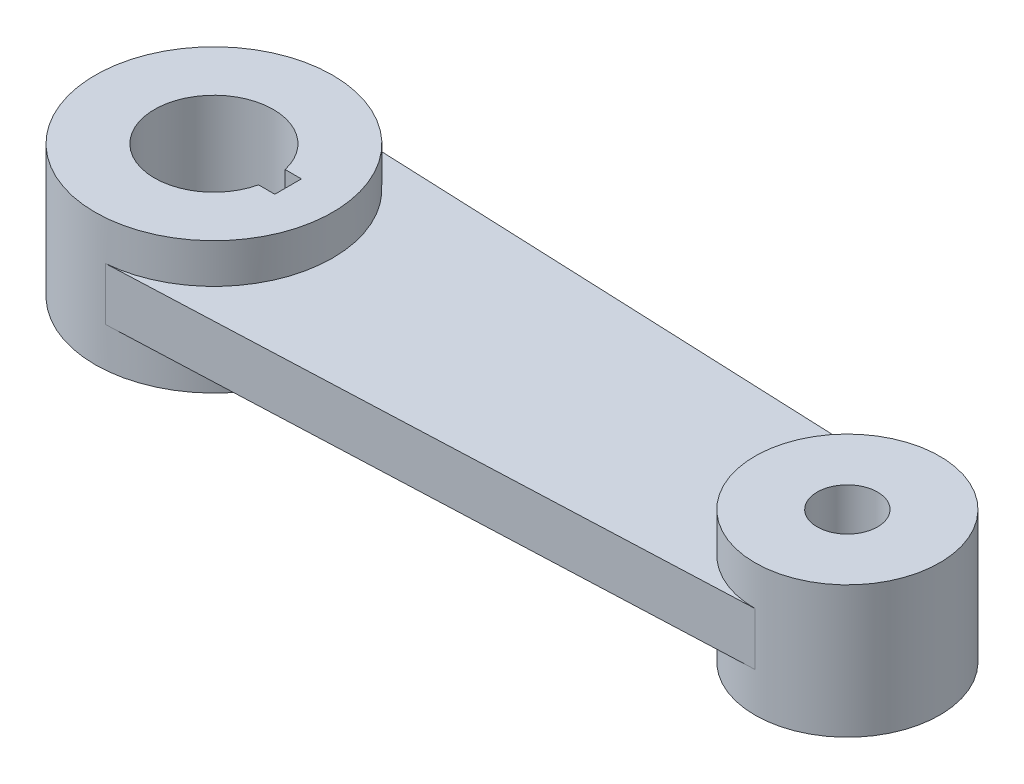
ISO-10303-21;
HEADER;
FILE_DESCRIPTION(('STEP AP214'),'2;1');
FILE_NAME('part.step','',(''),(''),'','','');
FILE_SCHEMA(('AUTOMOTIVE_DESIGN { 1 0 10303 214 1 1 1 1 }'));
ENDSEC;
DATA;
#1=APPLICATION_CONTEXT('core data for automotive mechanical design processes');
#2=APPLICATION_PROTOCOL_DEFINITION('international standard','automotive_design',2000,#1);
#3=PRODUCT_CONTEXT('',#1,'mechanical');
#4=PRODUCT('Part','Part','',(#3));
#5=PRODUCT_RELATED_PRODUCT_CATEGORY('part','',(#4));
#6=PRODUCT_DEFINITION_FORMATION('','',#4);
#7=PRODUCT_DEFINITION_CONTEXT('part definition',#1,'design');
#8=PRODUCT_DEFINITION('design','',#6,#7);
#9=PRODUCT_DEFINITION_SHAPE('','',#8);
#10=(LENGTH_UNIT() NAMED_UNIT(*) SI_UNIT(.MILLI.,.METRE.));
#11=(NAMED_UNIT(*) PLANE_ANGLE_UNIT() SI_UNIT($,.RADIAN.));
#12=(NAMED_UNIT(*) SI_UNIT($,.STERADIAN.) SOLID_ANGLE_UNIT());
#13=UNCERTAINTY_MEASURE_WITH_UNIT(LENGTH_MEASURE(1.E-05),#10,'distance_accuracy_value','');
#14=(GEOMETRIC_REPRESENTATION_CONTEXT(3) GLOBAL_UNCERTAINTY_ASSIGNED_CONTEXT((#13)) GLOBAL_UNIT_ASSIGNED_CONTEXT((#10,
#11,#12)) REPRESENTATION_CONTEXT('',''));
#15=CARTESIAN_POINT('',(0.,0.,0.));
#16=DIRECTION('',(0.,0.,1.));
#17=DIRECTION('',(1.,0.,0.));
#18=AXIS2_PLACEMENT_3D('',#15,#16,#17);
#19=CARTESIAN_POINT('',(150.,31.25,0.));
#20=DIRECTION('',(0.,1.,0.));
#21=DIRECTION('',(0.,0.,1.));
#22=AXIS2_PLACEMENT_3D('',#19,#20,#21);
#23=PLANE('',#22);
#24=CARTESIAN_POINT('',(150.,31.25,0.));
#25=DIRECTION('',(0.,1.,0.));
#26=DIRECTION('',(0.,0.,1.));
#27=AXIS2_PLACEMENT_3D('',#24,#25,#26);
#28=CIRCLE('',#27,14.3009812980512);
#29=CARTESIAN_POINT('',(150.,31.25,14.3009812980511));
#30=VERTEX_POINT('',#29);
#31=EDGE_CURVE('E131',#30,#30,#28,.T.);
#32=ORIENTED_EDGE('',*,*,#31,.F.);
#33=EDGE_LOOP('',(#32));
#34=FACE_BOUND('',#33,.T.);
#35=CARTESIAN_POINT('',(150.,31.25,0.));
#36=DIRECTION('',(0.,1.,0.));
#37=DIRECTION('',(0.,0.,1.));
#38=AXIS2_PLACEMENT_3D('',#35,#36,#37);
#39=CIRCLE('',#38,43.75);
#40=CARTESIAN_POINT('',(150.,31.25,43.75));
#41=VERTEX_POINT('',#40);
#42=EDGE_CURVE('E149',#41,#41,#39,.T.);
#43=ORIENTED_EDGE('',*,*,#42,.T.);
#44=EDGE_LOOP('',(#43));
#45=FACE_BOUND('',#44,.T.);
#46=ADVANCED_FACE('F33',(#34,#45),#23,.T.);
#47=CARTESIAN_POINT('',(2.07972270363952,12.5,49.9133448873483));
#48=DIRECTION('',(0.0416305447121814,0.,0.999133073092352));
#49=DIRECTION('',(0.999133073092352,0.,-0.0416305447121814));
#50=AXIS2_PLACEMENT_3D('',#47,#48,#49);
#51=PLANE('',#50);
#52=DIRECTION('',(0.,1.,0.));
#53=VECTOR('',#52,1.);
#54=CARTESIAN_POINT('',(-145.320623916811,-31.25,56.0550259965338));
#55=LINE('',#54,#53);
#56=CARTESIAN_POINT('',(-145.320623916811,-12.5,56.0550259965338));
#57=VERTEX_POINT('',#56);
#58=CARTESIAN_POINT('',(-145.320623916811,12.5,56.0550259965338));
#59=VERTEX_POINT('',#58);
#60=EDGE_CURVE('E150',#57,#59,#55,.T.);
#61=ORIENTED_EDGE('',*,*,#60,.F.);
#62=DIRECTION('',(-0.999133073092352,0.,0.0416305447121814));
#63=VECTOR('',#62,1.);
#64=CARTESIAN_POINT('',(2.07972270363952,-12.5,49.9133448873483));
#65=LINE('',#64,#63);
#66=CARTESIAN_POINT('',(150.,-12.5,43.75));
#67=VERTEX_POINT('',#66);
#68=EDGE_CURVE('E161',#67,#57,#65,.T.);
#69=ORIENTED_EDGE('',*,*,#68,.F.);
#70=DIRECTION('',(0.,-1.,0.));
#71=VECTOR('',#70,1.);
#72=CARTESIAN_POINT('',(150.,12.5,43.75));
#73=LINE('',#72,#71);
#74=CARTESIAN_POINT('',(150.,12.5,43.75));
#75=VERTEX_POINT('',#74);
#76=EDGE_CURVE('E174',#75,#67,#73,.T.);
#77=ORIENTED_EDGE('',*,*,#76,.F.);
#78=DIRECTION('',(-0.999133073092352,0.,0.0416305447121814));
#79=VECTOR('',#78,1.);
#80=CARTESIAN_POINT('',(2.07972270363952,12.5,49.9133448873483));
#81=LINE('',#80,#79);
#82=EDGE_CURVE('E162',#75,#59,#81,.T.);
#83=ORIENTED_EDGE('',*,*,#82,.T.);
#84=EDGE_LOOP('',(#61,#69,#77,#83));
#85=FACE_BOUND('',#84,.T.);
#86=ADVANCED_FACE('F35',(#85),#51,.T.);
#87=CARTESIAN_POINT('',(150.,12.5,0.));
#88=DIRECTION('',(0.,-1.,0.));
#89=DIRECTION('',(0.,0.,-1.));
#90=AXIS2_PLACEMENT_3D('',#87,#88,#89);
#91=CYLINDRICAL_SURFACE('',#90,43.75);
#92=ORIENTED_EDGE('',*,*,#76,.T.);
#93=CARTESIAN_POINT('',(150.,-12.5,0.));
#94=DIRECTION('',(0.,1.,0.));
#95=DIRECTION('',(0.,0.,1.));
#96=AXIS2_PLACEMENT_3D('',#93,#94,#95);
#97=CIRCLE('',#96,43.75);
#98=CARTESIAN_POINT('',(150.,-12.5,-43.7500000000001));
#99=VERTEX_POINT('',#98);
#100=EDGE_CURVE('E41',#99,#67,#97,.T.);
#101=ORIENTED_EDGE('',*,*,#100,.F.);
#102=DIRECTION('',(0.,-1.,0.));
#103=VECTOR('',#102,1.);
#104=CARTESIAN_POINT('',(150.,12.5,-43.7500000000001));
#105=LINE('',#104,#103);
#106=CARTESIAN_POINT('',(150.,12.5,-43.7500000000001));
#107=VERTEX_POINT('',#106);
#108=EDGE_CURVE('E168',#107,#99,#105,.T.);
#109=ORIENTED_EDGE('',*,*,#108,.F.);
#110=CARTESIAN_POINT('',(150.,12.5,0.));
#111=DIRECTION('',(0.,1.,0.));
#112=DIRECTION('',(0.,0.,1.));
#113=AXIS2_PLACEMENT_3D('',#110,#111,#112);
#114=CIRCLE('',#113,43.75);
#115=EDGE_CURVE('E158',#107,#75,#114,.T.);
#116=ORIENTED_EDGE('',*,*,#115,.T.);
#117=EDGE_LOOP('',(#92,#101,#109,#116));
#118=FACE_BOUND('',#117,.T.);
#119=CARTESIAN_POINT('',(150.,-31.25,0.));
#120=DIRECTION('',(0.,1.,0.));
#121=DIRECTION('',(0.,0.,1.));
#122=AXIS2_PLACEMENT_3D('',#119,#120,#121);
#123=CIRCLE('',#122,43.75);
#124=CARTESIAN_POINT('',(150.,-31.25,43.75));
#125=VERTEX_POINT('',#124);
#126=EDGE_CURVE('E155',#125,#125,#123,.T.);
#127=ORIENTED_EDGE('',*,*,#126,.T.);
#128=EDGE_LOOP('',(#127));
#129=FACE_BOUND('',#128,.T.);
#130=ORIENTED_EDGE('',*,*,#42,.F.);
#131=EDGE_LOOP('',(#130));
#132=FACE_BOUND('',#131,.T.);
#133=ADVANCED_FACE('F184',(#118,#129,#132),#91,.T.);
#134=CARTESIAN_POINT('',(2.0797227036395,12.5,-49.9133448873484));
#135=DIRECTION('',(0.0416305447121811,0.,-0.999133073092352));
#136=DIRECTION('',(-0.999133073092352,0.,-0.0416305447121811));
#137=AXIS2_PLACEMENT_3D('',#134,#135,#136);
#138=PLANE('',#137);
#139=DIRECTION('',(0.,1.,0.));
#140=VECTOR('',#139,1.);
#141=CARTESIAN_POINT('',(-145.320623916812,-31.25,-56.0550259965338));
#142=LINE('',#141,#140);
#143=CARTESIAN_POINT('',(-145.320623916812,12.5,-56.0550259965338));
#144=VERTEX_POINT('',#143);
#145=CARTESIAN_POINT('',(-145.320623916811,-12.5,-56.0550259965338));
#146=VERTEX_POINT('',#145);
#147=EDGE_CURVE('E146',#144,#146,#142,.F.);
#148=ORIENTED_EDGE('',*,*,#147,.F.);
#149=DIRECTION('',(0.999133073092352,0.,0.0416305447121811));
#150=VECTOR('',#149,1.);
#151=CARTESIAN_POINT('',(2.0797227036395,12.5,-49.9133448873484));
#152=LINE('',#151,#150);
#153=EDGE_CURVE('E165',#144,#107,#152,.T.);
#154=ORIENTED_EDGE('',*,*,#153,.T.);
#155=ORIENTED_EDGE('',*,*,#108,.T.);
#156=DIRECTION('',(0.999133073092352,0.,0.0416305447121811));
#157=VECTOR('',#156,1.);
#158=CARTESIAN_POINT('',(2.0797227036395,-12.5,-49.9133448873484));
#159=LINE('',#158,#157);
#160=EDGE_CURVE('E166',#146,#99,#159,.T.);
#161=ORIENTED_EDGE('',*,*,#160,.F.);
#162=EDGE_LOOP('',(#148,#154,#155,#161));
#163=FACE_BOUND('',#162,.T.);
#164=ADVANCED_FACE('F198',(#163),#138,.T.);
#165=CARTESIAN_POINT('',(0.,12.5,0.));
#166=DIRECTION('',(0.,1.,0.));
#167=DIRECTION('',(0.,0.,1.));
#168=AXIS2_PLACEMENT_3D('',#165,#166,#167);
#169=PLANE('',#168);
#170=CARTESIAN_POINT('',(-150.,12.5,0.));
#171=DIRECTION('',(0.,1.,0.));
#172=DIRECTION('',(0.,0.,1.));
#173=AXIS2_PLACEMENT_3D('',#170,#171,#172);
#174=CIRCLE('',#173,56.25);
#175=EDGE_CURVE('E147',#59,#144,#174,.T.);
#176=ORIENTED_EDGE('',*,*,#175,.F.);
#177=ORIENTED_EDGE('',*,*,#82,.F.);
#178=ORIENTED_EDGE('',*,*,#115,.F.);
#179=ORIENTED_EDGE('',*,*,#153,.F.);
#180=EDGE_LOOP('',(#176,#177,#178,#179));
#181=FACE_BOUND('',#180,.T.);
#182=ADVANCED_FACE('F196',(#181),#169,.T.);
#183=CARTESIAN_POINT('',(0.,-12.5,0.));
#184=DIRECTION('',(0.,1.,0.));
#185=DIRECTION('',(0.,0.,1.));
#186=AXIS2_PLACEMENT_3D('',#183,#184,#185);
#187=PLANE('',#186);
#188=ORIENTED_EDGE('',*,*,#68,.T.);
#189=CARTESIAN_POINT('',(-150.,-12.5,0.));
#190=DIRECTION('',(0.,1.,0.));
#191=DIRECTION('',(0.,0.,1.));
#192=AXIS2_PLACEMENT_3D('',#189,#190,#191);
#193=CIRCLE('',#192,56.25);
#194=EDGE_CURVE('E11',#57,#146,#193,.T.);
#195=ORIENTED_EDGE('',*,*,#194,.T.);
#196=ORIENTED_EDGE('',*,*,#160,.T.);
#197=ORIENTED_EDGE('',*,*,#100,.T.);
#198=EDGE_LOOP('',(#188,#195,#196,#197));
#199=FACE_BOUND('',#198,.T.);
#200=ADVANCED_FACE('F178',(#199),#187,.F.);
#201=CARTESIAN_POINT('',(150.,-31.25,0.));
#202=DIRECTION('',(0.,1.,0.));
#203=DIRECTION('',(0.,0.,1.));
#204=AXIS2_PLACEMENT_3D('',#201,#202,#203);
#205=PLANE('',#204);
#206=CARTESIAN_POINT('',(150.,-31.25,0.));
#207=DIRECTION('',(0.,1.,0.));
#208=DIRECTION('',(0.,0.,1.));
#209=AXIS2_PLACEMENT_3D('',#206,#207,#208);
#210=CIRCLE('',#209,14.3009812980512);
#211=CARTESIAN_POINT('',(150.,-31.25,14.3009812980511));
#212=VERTEX_POINT('',#211);
#213=EDGE_CURVE('E135',#212,#212,#210,.T.);
#214=ORIENTED_EDGE('',*,*,#213,.T.);
#215=EDGE_LOOP('',(#214));
#216=FACE_BOUND('',#215,.T.);
#217=ORIENTED_EDGE('',*,*,#126,.F.);
#218=EDGE_LOOP('',(#217));
#219=FACE_BOUND('',#218,.T.);
#220=ADVANCED_FACE('F218',(#216,#219),#205,.F.);
#221=CARTESIAN_POINT('',(-150.,-31.25,0.));
#222=DIRECTION('',(0.,1.,0.));
#223=DIRECTION('',(0.,0.,1.));
#224=AXIS2_PLACEMENT_3D('',#221,#222,#223);
#225=PLANE('',#224);
#226=DIRECTION('',(-1.,0.,0.));
#227=VECTOR('',#226,1.);
#228=CARTESIAN_POINT('',(-122.564029085888,-31.25,-6.3));
#229=LINE('',#228,#227);
#230=CARTESIAN_POINT('',(-114.864029085888,-31.25,-6.3));
#231=VERTEX_POINT('',#230);
#232=CARTESIAN_POINT('',(-122.564029085888,-31.25,-6.3));
#233=VERTEX_POINT('',#232);
#234=EDGE_CURVE('E106',#231,#233,#229,.T.);
#235=ORIENTED_EDGE('',*,*,#234,.T.);
#236=CARTESIAN_POINT('',(-150.,-31.25,0.));
#237=DIRECTION('',(0.,1.,0.));
#238=DIRECTION('',(0.,0.,1.));
#239=AXIS2_PLACEMENT_3D('',#236,#237,#238);
#240=CIRCLE('',#239,28.15);
#241=CARTESIAN_POINT('',(-122.564029085888,-31.25,6.3));
#242=VERTEX_POINT('',#241);
#243=EDGE_CURVE('E100',#233,#242,#240,.T.);
#244=ORIENTED_EDGE('',*,*,#243,.T.);
#245=DIRECTION('',(1.,0.,0.));
#246=VECTOR('',#245,1.);
#247=CARTESIAN_POINT('',(-122.564029085888,-31.25,6.3));
#248=LINE('',#247,#246);
#249=CARTESIAN_POINT('',(-114.864029085888,-31.25,6.3));
#250=VERTEX_POINT('',#249);
#251=EDGE_CURVE('E109',#242,#250,#248,.T.);
#252=ORIENTED_EDGE('',*,*,#251,.T.);
#253=DIRECTION('',(0.,0.,-1.));
#254=VECTOR('',#253,1.);
#255=CARTESIAN_POINT('',(-114.864029085888,-31.25,6.3));
#256=LINE('',#255,#254);
#257=EDGE_CURVE('E48',#250,#231,#256,.T.);
#258=ORIENTED_EDGE('',*,*,#257,.T.);
#259=EDGE_LOOP('',(#235,#244,#252,#258));
#260=FACE_BOUND('',#259,.T.);
#261=CARTESIAN_POINT('',(-150.,-31.25,0.));
#262=DIRECTION('',(0.,1.,0.));
#263=DIRECTION('',(0.,0.,1.));
#264=AXIS2_PLACEMENT_3D('',#261,#262,#263);
#265=CIRCLE('',#264,56.25);
#266=CARTESIAN_POINT('',(-150.,-31.25,56.25));
#267=VERTEX_POINT('',#266);
#268=EDGE_CURVE('E143',#267,#267,#265,.T.);
#269=ORIENTED_EDGE('',*,*,#268,.F.);
#270=EDGE_LOOP('',(#269));
#271=FACE_BOUND('',#270,.T.);
#272=ADVANCED_FACE('F113',(#260,#271),#225,.F.);
#273=CARTESIAN_POINT('',(-150.,31.25,0.));
#274=DIRECTION('',(0.,1.,0.));
#275=DIRECTION('',(0.,0.,1.));
#276=AXIS2_PLACEMENT_3D('',#273,#274,#275);
#277=PLANE('',#276);
#278=CARTESIAN_POINT('',(-150.,31.25,0.));
#279=DIRECTION('',(0.,1.,0.));
#280=DIRECTION('',(0.,0.,1.));
#281=AXIS2_PLACEMENT_3D('',#278,#279,#280);
#282=CIRCLE('',#281,28.15);
#283=CARTESIAN_POINT('',(-122.564029085888,31.25,-6.3));
#284=VERTEX_POINT('',#283);
#285=CARTESIAN_POINT('',(-122.564029085888,31.25,6.3));
#286=VERTEX_POINT('',#285);
#287=EDGE_CURVE('E56',#284,#286,#282,.T.);
#288=ORIENTED_EDGE('',*,*,#287,.F.);
#289=DIRECTION('',(-1.,0.,0.));
#290=VECTOR('',#289,1.);
#291=CARTESIAN_POINT('',(-122.564029085888,31.25,-6.3));
#292=LINE('',#291,#290);
#293=CARTESIAN_POINT('',(-114.864029085888,31.25,-6.3));
#294=VERTEX_POINT('',#293);
#295=EDGE_CURVE('E116',#294,#284,#292,.T.);
#296=ORIENTED_EDGE('',*,*,#295,.F.);
#297=DIRECTION('',(0.,0.,-1.));
#298=VECTOR('',#297,1.);
#299=CARTESIAN_POINT('',(-114.864029085888,31.25,6.3));
#300=LINE('',#299,#298);
#301=CARTESIAN_POINT('',(-114.864029085888,31.25,6.3));
#302=VERTEX_POINT('',#301);
#303=EDGE_CURVE('E119',#302,#294,#300,.T.);
#304=ORIENTED_EDGE('',*,*,#303,.F.);
#305=DIRECTION('',(1.,0.,0.));
#306=VECTOR('',#305,1.);
#307=CARTESIAN_POINT('',(-122.564029085888,31.25,6.3));
#308=LINE('',#307,#306);
#309=EDGE_CURVE('E125',#286,#302,#308,.T.);
#310=ORIENTED_EDGE('',*,*,#309,.F.);
#311=EDGE_LOOP('',(#288,#296,#304,#310));
#312=FACE_BOUND('',#311,.T.);
#313=CARTESIAN_POINT('',(-150.,31.25,0.));
#314=DIRECTION('',(0.,1.,0.));
#315=DIRECTION('',(0.,0.,1.));
#316=AXIS2_PLACEMENT_3D('',#313,#314,#315);
#317=CIRCLE('',#316,56.25);
#318=CARTESIAN_POINT('',(-150.,31.25,56.25));
#319=VERTEX_POINT('',#318);
#320=EDGE_CURVE('E138',#319,#319,#317,.T.);
#321=ORIENTED_EDGE('',*,*,#320,.T.);
#322=EDGE_LOOP('',(#321));
#323=FACE_BOUND('',#322,.T.);
#324=ADVANCED_FACE('F225',(#312,#323),#277,.T.);
#325=CARTESIAN_POINT('',(-150.,12.5,0.));
#326=DIRECTION('',(0.,-1.,0.));
#327=DIRECTION('',(0.,0.,-1.));
#328=AXIS2_PLACEMENT_3D('',#325,#326,#327);
#329=CYLINDRICAL_SURFACE('',#328,56.25);
#330=ORIENTED_EDGE('',*,*,#60,.T.);
#331=ORIENTED_EDGE('',*,*,#175,.T.);
#332=ORIENTED_EDGE('',*,*,#147,.T.);
#333=ORIENTED_EDGE('',*,*,#194,.F.);
#334=EDGE_LOOP('',(#330,#331,#332,#333));
#335=FACE_BOUND('',#334,.T.);
#336=ORIENTED_EDGE('',*,*,#268,.T.);
#337=EDGE_LOOP('',(#336));
#338=FACE_BOUND('',#337,.T.);
#339=ORIENTED_EDGE('',*,*,#320,.F.);
#340=EDGE_LOOP('',(#339));
#341=FACE_BOUND('',#340,.T.);
#342=ADVANCED_FACE('F191',(#335,#338,#341),#329,.T.);
#343=CARTESIAN_POINT('',(150.,-31.25,0.));
#344=DIRECTION('',(0.,1.,0.));
#345=DIRECTION('',(0.,0.,1.));
#346=AXIS2_PLACEMENT_3D('',#343,#344,#345);
#347=CYLINDRICAL_SURFACE('',#346,14.3009812980512);
#348=ORIENTED_EDGE('',*,*,#213,.F.);
#349=EDGE_LOOP('',(#348));
#350=FACE_BOUND('',#349,.T.);
#351=ORIENTED_EDGE('',*,*,#31,.T.);
#352=EDGE_LOOP('',(#351));
#353=FACE_BOUND('',#352,.T.);
#354=ADVANCED_FACE('F224',(#350,#353),#347,.F.);
#355=CARTESIAN_POINT('',(-150.,-31.25,0.));
#356=DIRECTION('',(0.,1.,0.));
#357=DIRECTION('',(0.,0.,1.));
#358=AXIS2_PLACEMENT_3D('',#355,#356,#357);
#359=CYLINDRICAL_SURFACE('',#358,28.15);
#360=ORIENTED_EDGE('',*,*,#287,.T.);
#361=DIRECTION('',(0.,1.,0.));
#362=VECTOR('',#361,1.);
#363=CARTESIAN_POINT('',(-122.564029085888,-31.25,6.3));
#364=LINE('',#363,#362);
#365=EDGE_CURVE('E96',#242,#286,#364,.T.);
#366=ORIENTED_EDGE('',*,*,#365,.F.);
#367=ORIENTED_EDGE('',*,*,#243,.F.);
#368=DIRECTION('',(0.,1.,0.));
#369=VECTOR('',#368,1.);
#370=CARTESIAN_POINT('',(-122.564029085888,-31.25,-6.3));
#371=LINE('',#370,#369);
#372=EDGE_CURVE('E129',#233,#284,#371,.T.);
#373=ORIENTED_EDGE('',*,*,#372,.T.);
#374=EDGE_LOOP('',(#360,#366,#367,#373));
#375=FACE_BOUND('',#374,.T.);
#376=ADVANCED_FACE('F98',(#375),#359,.F.);
#377=CARTESIAN_POINT('',(-122.564029085888,-31.25,-6.3));
#378=DIRECTION('',(0.,0.,-1.));
#379=DIRECTION('',(-1.,0.,0.));
#380=AXIS2_PLACEMENT_3D('',#377,#378,#379);
#381=PLANE('',#380);
#382=ORIENTED_EDGE('',*,*,#295,.T.);
#383=ORIENTED_EDGE('',*,*,#372,.F.);
#384=ORIENTED_EDGE('',*,*,#234,.F.);
#385=DIRECTION('',(0.,1.,0.));
#386=VECTOR('',#385,1.);
#387=CARTESIAN_POINT('',(-114.864029085888,-31.25,-6.3));
#388=LINE('',#387,#386);
#389=EDGE_CURVE('E132',#231,#294,#388,.T.);
#390=ORIENTED_EDGE('',*,*,#389,.T.);
#391=EDGE_LOOP('',(#382,#383,#384,#390));
#392=FACE_BOUND('',#391,.T.);
#393=ADVANCED_FACE('F240',(#392),#381,.F.);
#394=CARTESIAN_POINT('',(-114.864029085888,-31.25,6.3));
#395=DIRECTION('',(1.,0.,0.));
#396=DIRECTION('',(0.,0.,-1.));
#397=AXIS2_PLACEMENT_3D('',#394,#395,#396);
#398=PLANE('',#397);
#399=ORIENTED_EDGE('',*,*,#303,.T.);
#400=ORIENTED_EDGE('',*,*,#389,.F.);
#401=ORIENTED_EDGE('',*,*,#257,.F.);
#402=DIRECTION('',(0.,1.,0.));
#403=VECTOR('',#402,1.);
#404=CARTESIAN_POINT('',(-114.864029085888,-31.25,6.3));
#405=LINE('',#404,#403);
#406=EDGE_CURVE('E105',#250,#302,#405,.T.);
#407=ORIENTED_EDGE('',*,*,#406,.T.);
#408=EDGE_LOOP('',(#399,#400,#401,#407));
#409=FACE_BOUND('',#408,.T.);
#410=ADVANCED_FACE('F243',(#409),#398,.F.);
#411=CARTESIAN_POINT('',(-122.564029085888,-31.25,6.3));
#412=DIRECTION('',(0.,0.,1.));
#413=DIRECTION('',(1.,0.,0.));
#414=AXIS2_PLACEMENT_3D('',#411,#412,#413);
#415=PLANE('',#414);
#416=ORIENTED_EDGE('',*,*,#309,.T.);
#417=ORIENTED_EDGE('',*,*,#406,.F.);
#418=ORIENTED_EDGE('',*,*,#251,.F.);
#419=ORIENTED_EDGE('',*,*,#365,.T.);
#420=EDGE_LOOP('',(#416,#417,#418,#419));
#421=FACE_BOUND('',#420,.T.);
#422=ADVANCED_FACE('F110',(#421),#415,.F.);
#423=CLOSED_SHELL('',(#46,#86,#133,#164,#182,#200,#220,#272,#324,#342,#354,#376,#393,#410,#422));
#424=MANIFOLD_SOLID_BREP('B2',#423);
#425=ADVANCED_BREP_SHAPE_REPRESENTATION('',(#18,#424),#14);
#426=SHAPE_DEFINITION_REPRESENTATION(#9,#425);
ENDSEC;
END-ISO-10303-21;
